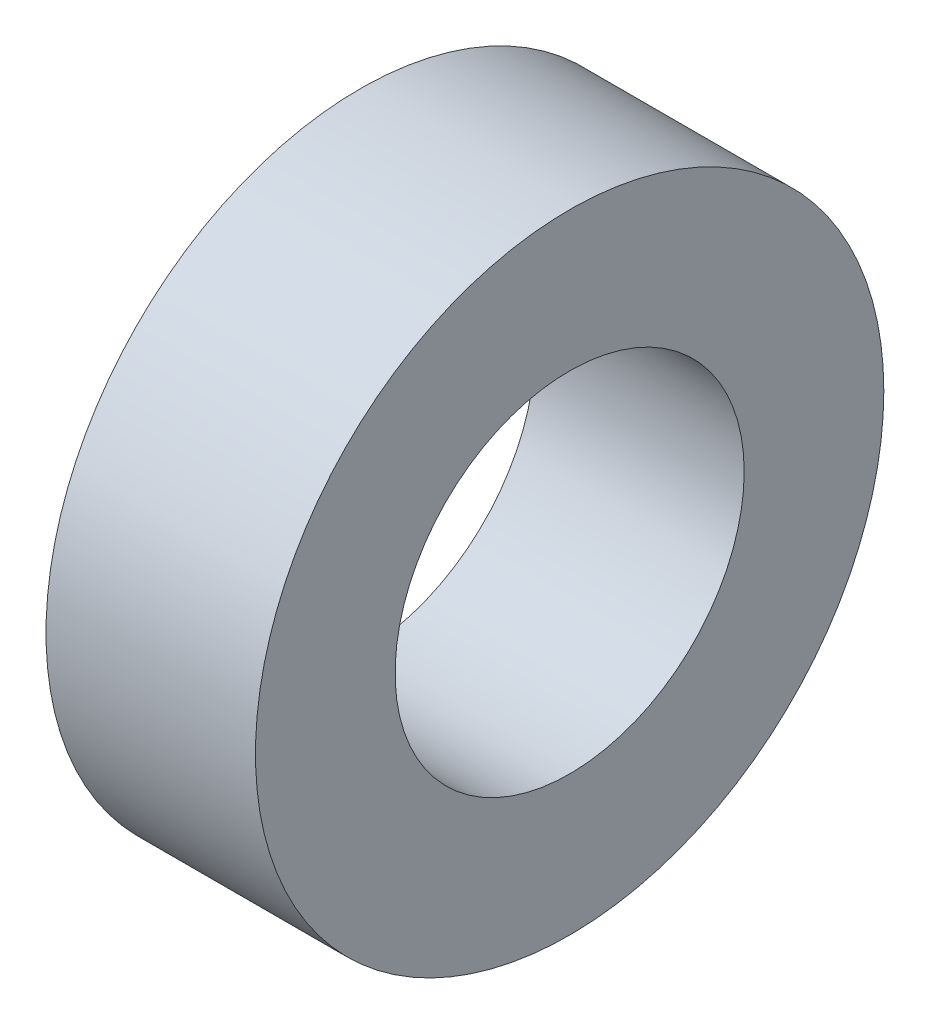
ISO-10303-21;
HEADER;
FILE_DESCRIPTION(('STEP AP214'),'2;1');
FILE_NAME('part.step','',(''),(''),'','','');
FILE_SCHEMA(('AUTOMOTIVE_DESIGN { 1 0 10303 214 1 1 1 1 }'));
ENDSEC;
DATA;
#1=APPLICATION_CONTEXT('core data for automotive mechanical design processes');
#2=APPLICATION_PROTOCOL_DEFINITION('international standard','automotive_design',2000,#1);
#3=PRODUCT_CONTEXT('',#1,'mechanical');
#4=PRODUCT('Part','Part','',(#3));
#5=PRODUCT_RELATED_PRODUCT_CATEGORY('part','',(#4));
#6=PRODUCT_DEFINITION_FORMATION('','',#4);
#7=PRODUCT_DEFINITION_CONTEXT('part definition',#1,'design');
#8=PRODUCT_DEFINITION('design','',#6,#7);
#9=PRODUCT_DEFINITION_SHAPE('','',#8);
#10=(LENGTH_UNIT() NAMED_UNIT(*) SI_UNIT(.MILLI.,.METRE.));
#11=(NAMED_UNIT(*) PLANE_ANGLE_UNIT() SI_UNIT($,.RADIAN.));
#12=(NAMED_UNIT(*) SI_UNIT($,.STERADIAN.) SOLID_ANGLE_UNIT());
#13=UNCERTAINTY_MEASURE_WITH_UNIT(LENGTH_MEASURE(1.E-05),#10,'distance_accuracy_value','');
#14=(GEOMETRIC_REPRESENTATION_CONTEXT(3) GLOBAL_UNCERTAINTY_ASSIGNED_CONTEXT((#13)) GLOBAL_UNIT_ASSIGNED_CONTEXT((#10,
#11,#12)) REPRESENTATION_CONTEXT('',''));
#15=CARTESIAN_POINT('',(0.,0.,0.));
#16=DIRECTION('',(0.,0.,1.));
#17=DIRECTION('',(1.,0.,0.));
#18=AXIS2_PLACEMENT_3D('',#15,#16,#17);
#19=CARTESIAN_POINT('',(3.,0.,0.));
#20=DIRECTION('',(1.,0.,0.));
#21=DIRECTION('',(0.,0.,-1.));
#22=AXIS2_PLACEMENT_3D('',#19,#20,#21);
#23=PLANE('',#22);
#24=CARTESIAN_POINT('',(3.,0.,0.));
#25=DIRECTION('',(1.,0.,0.));
#26=DIRECTION('',(0.,0.,-1.));
#27=AXIS2_PLACEMENT_3D('',#24,#25,#26);
#28=CIRCLE('',#27,4.5);
#29=CARTESIAN_POINT('',(3.,0.,-4.5));
#30=VERTEX_POINT('',#29);
#31=EDGE_CURVE('E10',#30,#30,#28,.T.);
#32=ORIENTED_EDGE('',*,*,#31,.T.);
#33=EDGE_LOOP('',(#32));
#34=FACE_BOUND('',#33,.T.);
#35=CARTESIAN_POINT('',(3.,0.,0.));
#36=DIRECTION('',(1.,0.,0.));
#37=DIRECTION('',(0.,0.,-1.));
#38=AXIS2_PLACEMENT_3D('',#35,#36,#37);
#39=CIRCLE('',#38,2.5);
#40=CARTESIAN_POINT('',(3.,0.,-2.5));
#41=VERTEX_POINT('',#40);
#42=EDGE_CURVE('E43',#41,#41,#39,.T.);
#43=ORIENTED_EDGE('',*,*,#42,.F.);
#44=EDGE_LOOP('',(#43));
#45=FACE_BOUND('',#44,.T.);
#46=ADVANCED_FACE('F32',(#34,#45),#23,.T.);
#47=CARTESIAN_POINT('',(0.,0.,0.));
#48=DIRECTION('',(1.,0.,0.));
#49=DIRECTION('',(0.,0.,-1.));
#50=AXIS2_PLACEMENT_3D('',#47,#48,#49);
#51=PLANE('',#50);
#52=CARTESIAN_POINT('',(0.,0.,0.));
#53=DIRECTION('',(1.,0.,0.));
#54=DIRECTION('',(0.,0.,-1.));
#55=AXIS2_PLACEMENT_3D('',#52,#53,#54);
#56=CIRCLE('',#55,4.5);
#57=CARTESIAN_POINT('',(0.,0.,-4.5));
#58=VERTEX_POINT('',#57);
#59=EDGE_CURVE('E36',#58,#58,#56,.T.);
#60=ORIENTED_EDGE('',*,*,#59,.F.);
#61=EDGE_LOOP('',(#60));
#62=FACE_BOUND('',#61,.T.);
#63=CARTESIAN_POINT('',(0.,0.,0.));
#64=DIRECTION('',(1.,0.,0.));
#65=DIRECTION('',(0.,0.,-1.));
#66=AXIS2_PLACEMENT_3D('',#63,#64,#65);
#67=CIRCLE('',#66,2.5);
#68=CARTESIAN_POINT('',(0.,0.,-2.5));
#69=VERTEX_POINT('',#68);
#70=EDGE_CURVE('E45',#69,#69,#67,.T.);
#71=ORIENTED_EDGE('',*,*,#70,.T.);
#72=EDGE_LOOP('',(#71));
#73=FACE_BOUND('',#72,.T.);
#74=ADVANCED_FACE('F55',(#62,#73),#51,.F.);
#75=CARTESIAN_POINT('',(3.,0.,0.));
#76=DIRECTION('',(-1.,0.,0.));
#77=DIRECTION('',(0.,0.,1.));
#78=AXIS2_PLACEMENT_3D('',#75,#76,#77);
#79=CYLINDRICAL_SURFACE('',#78,4.5);
#80=ORIENTED_EDGE('',*,*,#31,.F.);
#81=EDGE_LOOP('',(#80));
#82=FACE_BOUND('',#81,.T.);
#83=ORIENTED_EDGE('',*,*,#59,.T.);
#84=EDGE_LOOP('',(#83));
#85=FACE_BOUND('',#84,.T.);
#86=ADVANCED_FACE('F34',(#82,#85),#79,.T.);
#87=CARTESIAN_POINT('',(3.,0.,0.));
#88=DIRECTION('',(-1.,0.,0.));
#89=DIRECTION('',(0.,0.,1.));
#90=AXIS2_PLACEMENT_3D('',#87,#88,#89);
#91=CYLINDRICAL_SURFACE('',#90,2.5);
#92=ORIENTED_EDGE('',*,*,#42,.T.);
#93=EDGE_LOOP('',(#92));
#94=FACE_BOUND('',#93,.T.);
#95=ORIENTED_EDGE('',*,*,#70,.F.);
#96=EDGE_LOOP('',(#95));
#97=FACE_BOUND('',#96,.T.);
#98=ADVANCED_FACE('F51',(#94,#97),#91,.F.);
#99=CLOSED_SHELL('',(#46,#74,#86,#98));
#100=MANIFOLD_SOLID_BREP('B2',#99);
#101=ADVANCED_BREP_SHAPE_REPRESENTATION('',(#18,#100),#14);
#102=SHAPE_DEFINITION_REPRESENTATION(#9,#101);
ENDSEC;
END-ISO-10303-21;
